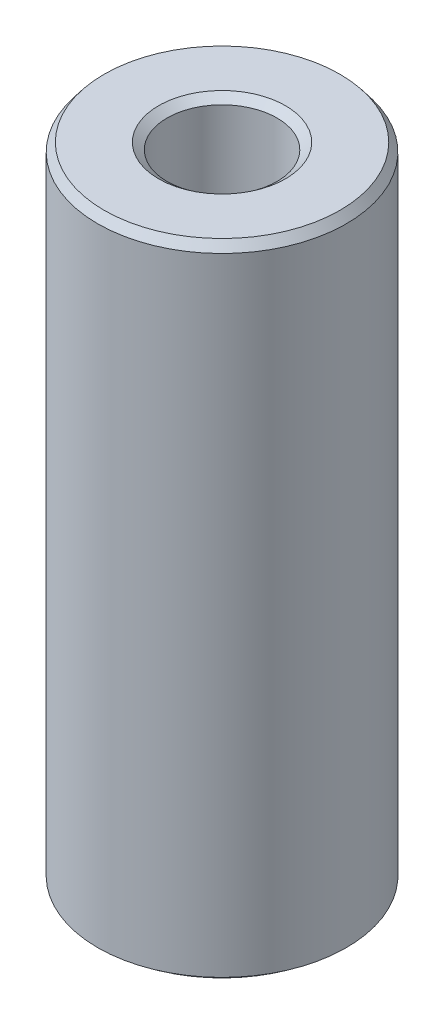
ISO-10303-21;
HEADER;
FILE_DESCRIPTION(('STEP AP214'),'2;1');
FILE_NAME('part.step','',(''),(''),'','','');
FILE_SCHEMA(('AUTOMOTIVE_DESIGN { 1 0 10303 214 1 1 1 1 }'));
ENDSEC;
DATA;
#1=APPLICATION_CONTEXT('core data for automotive mechanical design processes');
#2=APPLICATION_PROTOCOL_DEFINITION('international standard','automotive_design',2000,#1);
#3=PRODUCT_CONTEXT('',#1,'mechanical');
#4=PRODUCT('Part','Part','',(#3));
#5=PRODUCT_RELATED_PRODUCT_CATEGORY('part','',(#4));
#6=PRODUCT_DEFINITION_FORMATION('','',#4);
#7=PRODUCT_DEFINITION_CONTEXT('part definition',#1,'design');
#8=PRODUCT_DEFINITION('design','',#6,#7);
#9=PRODUCT_DEFINITION_SHAPE('','',#8);
#10=(LENGTH_UNIT() NAMED_UNIT(*) SI_UNIT(.MILLI.,.METRE.));
#11=(NAMED_UNIT(*) PLANE_ANGLE_UNIT() SI_UNIT($,.RADIAN.));
#12=(NAMED_UNIT(*) SI_UNIT($,.STERADIAN.) SOLID_ANGLE_UNIT());
#13=UNCERTAINTY_MEASURE_WITH_UNIT(LENGTH_MEASURE(1.E-05),#10,'distance_accuracy_value','');
#14=(GEOMETRIC_REPRESENTATION_CONTEXT(3) GLOBAL_UNCERTAINTY_ASSIGNED_CONTEXT((#13)) GLOBAL_UNIT_ASSIGNED_CONTEXT((#10,
#11,#12)) REPRESENTATION_CONTEXT('',''));
#15=CARTESIAN_POINT('',(0.,0.,0.));
#16=DIRECTION('',(0.,0.,1.));
#17=DIRECTION('',(1.,0.,0.));
#18=AXIS2_PLACEMENT_3D('',#15,#16,#17);
#19=CARTESIAN_POINT('',(0.,167.745233999579,0.));
#20=DIRECTION('',(0.,-1.,0.));
#21=DIRECTION('',(0.,0.,-1.));
#22=AXIS2_PLACEMENT_3D('',#19,#20,#21);
#23=CYLINDRICAL_SURFACE('',#22,32.5);
#24=CARTESIAN_POINT('',(0.,1.68434773139201,0.));
#25=DIRECTION('',(0.,1.,0.));
#26=DIRECTION('',(0.,0.,1.));
#27=AXIS2_PLACEMENT_3D('',#24,#25,#26);
#28=CIRCLE('',#27,32.5);
#29=CARTESIAN_POINT('',(0.,1.68434773139201,32.5));
#30=VERTEX_POINT('',#29);
#31=EDGE_CURVE('E10',#30,#30,#28,.T.);
#32=ORIENTED_EDGE('',*,*,#31,.T.);
#33=EDGE_LOOP('',(#32));
#34=FACE_BOUND('',#33,.T.);
#35=CARTESIAN_POINT('',(0.,165.54345825562,0.));
#36=DIRECTION('',(0.,1.,0.));
#37=DIRECTION('',(0.,0.,1.));
#38=AXIS2_PLACEMENT_3D('',#35,#36,#37);
#39=CIRCLE('',#38,32.5);
#40=CARTESIAN_POINT('',(0.,165.54345825562,32.5));
#41=VERTEX_POINT('',#40);
#42=EDGE_CURVE('E50',#41,#41,#39,.F.);
#43=ORIENTED_EDGE('',*,*,#42,.T.);
#44=EDGE_LOOP('',(#43));
#45=FACE_BOUND('',#44,.T.);
#46=ADVANCED_FACE('F39',(#34,#45),#23,.T.);
#47=CARTESIAN_POINT('',(0.,167.745233999579,0.));
#48=DIRECTION('',(0.,1.,0.));
#49=DIRECTION('',(0.,0.,1.));
#50=AXIS2_PLACEMENT_3D('',#47,#48,#49);
#51=PLANE('',#50);
#52=CARTESIAN_POINT('',(0.,167.745233999579,0.));
#53=DIRECTION('',(0.,1.,0.));
#54=DIRECTION('',(0.,0.,1.));
#55=AXIS2_PLACEMENT_3D('',#52,#53,#54);
#56=CIRCLE('',#55,16.5787663149606);
#57=CARTESIAN_POINT('',(0.,167.745233999579,16.5787663149606));
#58=VERTEX_POINT('',#57);
#59=EDGE_CURVE('E58',#58,#58,#56,.F.);
#60=ORIENTED_EDGE('',*,*,#59,.T.);
#61=EDGE_LOOP('',(#60));
#62=FACE_BOUND('',#61,.T.);
#63=CARTESIAN_POINT('',(0.,167.745233999579,0.));
#64=DIRECTION('',(0.,1.,0.));
#65=DIRECTION('',(0.,0.,1.));
#66=AXIS2_PLACEMENT_3D('',#63,#64,#65);
#67=CIRCLE('',#66,30.815652268608);
#68=CARTESIAN_POINT('',(0.,167.745233999579,30.815652268608));
#69=VERTEX_POINT('',#68);
#70=EDGE_CURVE('E61',#69,#69,#67,.T.);
#71=ORIENTED_EDGE('',*,*,#70,.T.);
#72=EDGE_LOOP('',(#71));
#73=FACE_BOUND('',#72,.T.);
#74=ADVANCED_FACE('F88',(#62,#73),#51,.T.);
#75=CARTESIAN_POINT('',(0.,0.,0.));
#76=DIRECTION('',(0.,1.,0.));
#77=DIRECTION('',(0.,0.,1.));
#78=AXIS2_PLACEMENT_3D('',#75,#76,#77);
#79=PLANE('',#78);
#80=CARTESIAN_POINT('',(0.,0.,0.));
#81=DIRECTION('',(0.,1.,0.));
#82=DIRECTION('',(0.,0.,1.));
#83=AXIS2_PLACEMENT_3D('',#80,#81,#82);
#84=CIRCLE('',#83,16.0613383023938);
#85=CARTESIAN_POINT('',(0.,0.,16.0613383023938));
#86=VERTEX_POINT('',#85);
#87=EDGE_CURVE('E51',#86,#86,#84,.T.);
#88=ORIENTED_EDGE('',*,*,#87,.T.);
#89=EDGE_LOOP('',(#88));
#90=FACE_BOUND('',#89,.T.);
#91=CARTESIAN_POINT('',(0.,0.,0.));
#92=DIRECTION('',(0.,1.,0.));
#93=DIRECTION('',(0.,0.,1.));
#94=AXIS2_PLACEMENT_3D('',#91,#92,#93);
#95=CIRCLE('',#94,30.2982242560412);
#96=CARTESIAN_POINT('',(0.,0.,30.2982242560412));
#97=VERTEX_POINT('',#96);
#98=EDGE_CURVE('E54',#97,#97,#95,.F.);
#99=ORIENTED_EDGE('',*,*,#98,.T.);
#100=EDGE_LOOP('',(#99));
#101=FACE_BOUND('',#100,.T.);
#102=ADVANCED_FACE('F83',(#90,#101),#79,.F.);
#103=CARTESIAN_POINT('',(0.,167.745233999579,0.));
#104=DIRECTION('',(0.,-1.,0.));
#105=DIRECTION('',(0.,0.,-1.));
#106=AXIS2_PLACEMENT_3D('',#103,#104,#105);
#107=CYLINDRICAL_SURFACE('',#106,14.3769905710019);
#108=CARTESIAN_POINT('',(0.,166.060886268187,0.));
#109=DIRECTION('',(0.,1.,0.));
#110=DIRECTION('',(0.,0.,1.));
#111=AXIS2_PLACEMENT_3D('',#108,#109,#110);
#112=CIRCLE('',#111,14.3769905710019);
#113=CARTESIAN_POINT('',(0.,166.060886268187,14.3769905710019));
#114=VERTEX_POINT('',#113);
#115=EDGE_CURVE('E67',#114,#114,#112,.T.);
#116=ORIENTED_EDGE('',*,*,#115,.T.);
#117=EDGE_LOOP('',(#116));
#118=FACE_BOUND('',#117,.T.);
#119=CARTESIAN_POINT('',(0.,2.2017757439588,0.));
#120=DIRECTION('',(0.,1.,0.));
#121=DIRECTION('',(0.,0.,1.));
#122=AXIS2_PLACEMENT_3D('',#119,#120,#121);
#123=CIRCLE('',#122,14.3769905710019);
#124=CARTESIAN_POINT('',(0.,2.2017757439588,14.3769905710019));
#125=VERTEX_POINT('',#124);
#126=EDGE_CURVE('E69',#125,#125,#123,.F.);
#127=ORIENTED_EDGE('',*,*,#126,.T.);
#128=EDGE_LOOP('',(#127));
#129=FACE_BOUND('',#128,.T.);
#130=ADVANCED_FACE('F71',(#118,#129),#107,.F.);
#131=CARTESIAN_POINT('',(0.,166.060886268187,0.));
#132=DIRECTION('',(0.,1.,0.));
#133=DIRECTION('',(0.,0.,1.));
#134=AXIS2_PLACEMENT_3D('',#131,#132,#133);
#135=CONICAL_SURFACE('',#134,14.3769905710019,0.9177672017986);
#136=ORIENTED_EDGE('',*,*,#59,.F.);
#137=EDGE_LOOP('',(#136));
#138=FACE_BOUND('',#137,.T.);
#139=ORIENTED_EDGE('',*,*,#115,.F.);
#140=EDGE_LOOP('',(#139));
#141=FACE_BOUND('',#140,.T.);
#142=ADVANCED_FACE('F77',(#138,#141),#135,.F.);
#143=CARTESIAN_POINT('',(0.,0.,0.));
#144=DIRECTION('',(0.,-1.,0.));
#145=DIRECTION('',(0.,0.,-1.));
#146=AXIS2_PLACEMENT_3D('',#143,#144,#145);
#147=CONICAL_SURFACE('',#146,16.0613383023938,0.653029124996286);
#148=ORIENTED_EDGE('',*,*,#126,.F.);
#149=EDGE_LOOP('',(#148));
#150=FACE_BOUND('',#149,.T.);
#151=ORIENTED_EDGE('',*,*,#87,.F.);
#152=EDGE_LOOP('',(#151));
#153=FACE_BOUND('',#152,.T.);
#154=ADVANCED_FACE('F73',(#150,#153),#147,.F.);
#155=CARTESIAN_POINT('',(0.,1.68434773139201,0.));
#156=DIRECTION('',(0.,1.,0.));
#157=DIRECTION('',(0.,0.,1.));
#158=AXIS2_PLACEMENT_3D('',#155,#156,#157);
#159=CONICAL_SURFACE('',#158,32.5,0.917767201798614);
#160=ORIENTED_EDGE('',*,*,#98,.F.);
#161=EDGE_LOOP('',(#160));
#162=FACE_BOUND('',#161,.T.);
#163=ORIENTED_EDGE('',*,*,#31,.F.);
#164=EDGE_LOOP('',(#163));
#165=FACE_BOUND('',#164,.T.);
#166=ADVANCED_FACE('F76',(#162,#165),#159,.T.);
#167=CARTESIAN_POINT('',(0.,167.745233999579,0.));
#168=DIRECTION('',(0.,-1.,0.));
#169=DIRECTION('',(0.,0.,-1.));
#170=AXIS2_PLACEMENT_3D('',#167,#168,#169);
#171=CONICAL_SURFACE('',#170,30.815652268608,0.653029124996293);
#172=ORIENTED_EDGE('',*,*,#42,.F.);
#173=EDGE_LOOP('',(#172));
#174=FACE_BOUND('',#173,.T.);
#175=ORIENTED_EDGE('',*,*,#70,.F.);
#176=EDGE_LOOP('',(#175));
#177=FACE_BOUND('',#176,.T.);
#178=ADVANCED_FACE('F45',(#174,#177),#171,.T.);
#179=CLOSED_SHELL('',(#46,#74,#102,#130,#142,#154,#166,#178));
#180=MANIFOLD_SOLID_BREP('B2',#179);
#181=ADVANCED_BREP_SHAPE_REPRESENTATION('',(#18,#180),#14);
#182=SHAPE_DEFINITION_REPRESENTATION(#9,#181);
ENDSEC;
END-ISO-10303-21;
